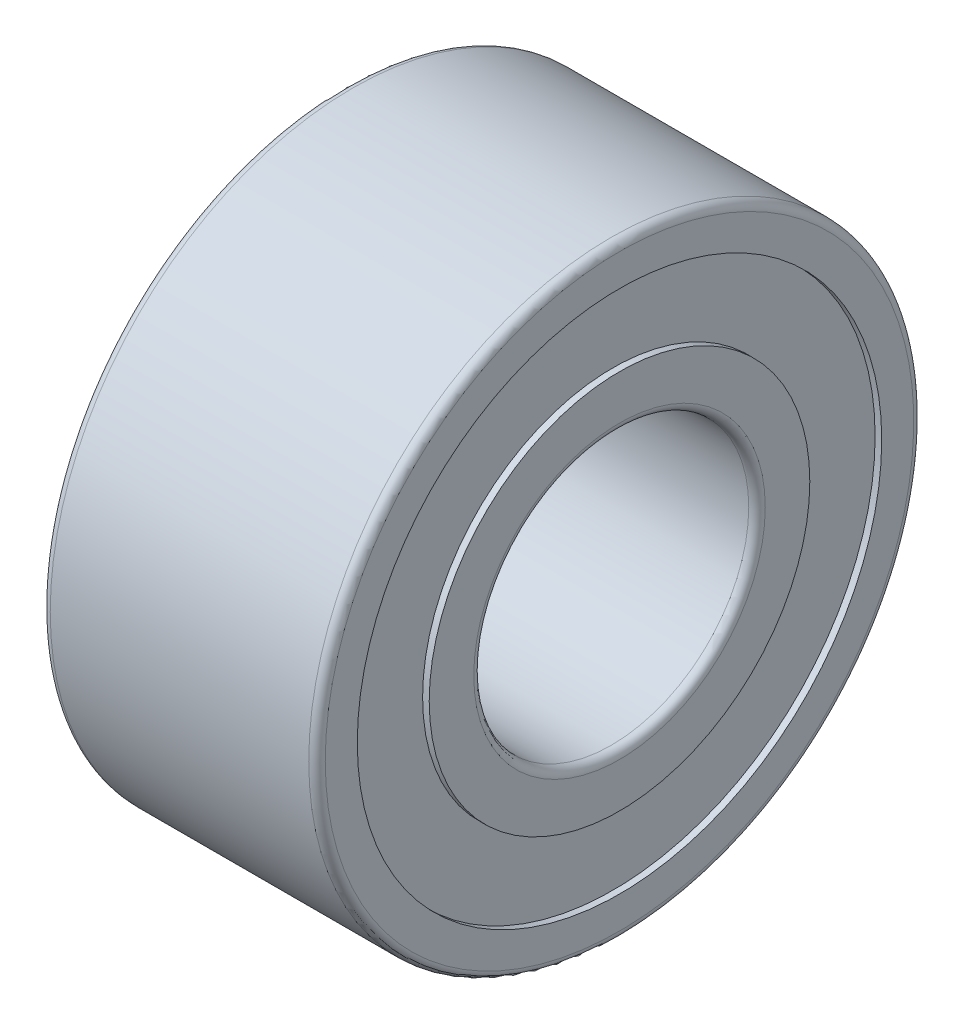
ISO-10303-21;
HEADER;
FILE_DESCRIPTION(('STEP AP214'),'2;1');
FILE_NAME('part.step','',(''),(''),'','','');
FILE_SCHEMA(('AUTOMOTIVE_DESIGN { 1 0 10303 214 1 1 1 1 }'));
ENDSEC;
DATA;
#1=APPLICATION_CONTEXT('core data for automotive mechanical design processes');
#2=APPLICATION_PROTOCOL_DEFINITION('international standard','automotive_design',2000,#1);
#3=PRODUCT_CONTEXT('',#1,'mechanical');
#4=PRODUCT('Part','Part','',(#3));
#5=PRODUCT_RELATED_PRODUCT_CATEGORY('part','',(#4));
#6=PRODUCT_DEFINITION_FORMATION('','',#4);
#7=PRODUCT_DEFINITION_CONTEXT('part definition',#1,'design');
#8=PRODUCT_DEFINITION('design','',#6,#7);
#9=PRODUCT_DEFINITION_SHAPE('','',#8);
#10=(LENGTH_UNIT() NAMED_UNIT(*) SI_UNIT(.MILLI.,.METRE.));
#11=(NAMED_UNIT(*) PLANE_ANGLE_UNIT() SI_UNIT($,.RADIAN.));
#12=(NAMED_UNIT(*) SI_UNIT($,.STERADIAN.) SOLID_ANGLE_UNIT());
#13=UNCERTAINTY_MEASURE_WITH_UNIT(LENGTH_MEASURE(1.E-05),#10,'distance_accuracy_value','');
#14=(GEOMETRIC_REPRESENTATION_CONTEXT(3) GLOBAL_UNCERTAINTY_ASSIGNED_CONTEXT((#13)) GLOBAL_UNIT_ASSIGNED_CONTEXT((#10,
#11,#12)) REPRESENTATION_CONTEXT('',''));
#15=CARTESIAN_POINT('',(0.,0.,0.));
#16=DIRECTION('',(0.,0.,1.));
#17=DIRECTION('',(1.,0.,0.));
#18=AXIS2_PLACEMENT_3D('',#15,#16,#17);
#19=CARTESIAN_POINT('',(0.,5.5,0.));
#20=DIRECTION('',(1.,0.,0.));
#21=DIRECTION('',(0.,0.,-1.));
#22=AXIS2_PLACEMENT_3D('',#19,#20,#21);
#23=PLANE('',#22);
#24=CARTESIAN_POINT('',(0.,0.,0.));
#25=DIRECTION('',(1.,0.,0.));
#26=DIRECTION('',(0.,0.,-1.));
#27=AXIS2_PLACEMENT_3D('',#24,#25,#26);
#28=CIRCLE('',#27,5.35);
#29=CARTESIAN_POINT('',(0.,0.,-5.35));
#30=VERTEX_POINT('',#29);
#31=EDGE_CURVE('E65',#30,#30,#28,.F.);
#32=ORIENTED_EDGE('',*,*,#31,.T.);
#33=EDGE_LOOP('',(#32));
#34=FACE_BOUND('',#33,.T.);
#35=CARTESIAN_POINT('',(0.,0.,0.));
#36=DIRECTION('',(-1.,0.,0.));
#37=DIRECTION('',(0.,0.,1.));
#38=AXIS2_PLACEMENT_3D('',#35,#36,#37);
#39=CIRCLE('',#38,4.7675);
#40=CARTESIAN_POINT('',(0.,0.,4.7675));
#41=VERTEX_POINT('',#40);
#42=EDGE_CURVE('E80',#41,#41,#39,.T.);
#43=ORIENTED_EDGE('',*,*,#42,.F.);
#44=EDGE_LOOP('',(#43));
#45=FACE_BOUND('',#44,.T.);
#46=ADVANCED_FACE('F37',(#34,#45),#23,.F.);
#47=CARTESIAN_POINT('',(0.,0.,0.));
#48=DIRECTION('',(-1.,0.,0.));
#49=DIRECTION('',(0.,0.,1.));
#50=AXIS2_PLACEMENT_3D('',#47,#48,#49);
#51=CYLINDRICAL_SURFACE('',#50,4.7675);
#52=CARTESIAN_POINT('',(0.12,0.,0.));
#53=DIRECTION('',(-1.,0.,0.));
#54=DIRECTION('',(0.,0.,1.));
#55=AXIS2_PLACEMENT_3D('',#52,#53,#54);
#56=CIRCLE('',#55,4.7675);
#57=CARTESIAN_POINT('',(0.12,0.,4.7675));
#58=VERTEX_POINT('',#57);
#59=EDGE_CURVE('E83',#58,#58,#56,.T.);
#60=ORIENTED_EDGE('',*,*,#59,.F.);
#61=EDGE_LOOP('',(#60));
#62=FACE_BOUND('',#61,.T.);
#63=ORIENTED_EDGE('',*,*,#42,.T.);
#64=EDGE_LOOP('',(#63));
#65=FACE_BOUND('',#64,.T.);
#66=ADVANCED_FACE('F142',(#62,#65),#51,.F.);
#67=CARTESIAN_POINT('',(0.12,4.7675,0.));
#68=DIRECTION('',(1.,0.,0.));
#69=DIRECTION('',(0.,0.,-1.));
#70=AXIS2_PLACEMENT_3D('',#67,#68,#69);
#71=PLANE('',#70);
#72=CARTESIAN_POINT('',(0.12,0.,0.));
#73=DIRECTION('',(-1.,0.,0.));
#74=DIRECTION('',(0.,0.,1.));
#75=AXIS2_PLACEMENT_3D('',#72,#73,#74);
#76=CIRCLE('',#75,3.46);
#77=CARTESIAN_POINT('',(0.12,0.,3.46));
#78=VERTEX_POINT('',#77);
#79=EDGE_CURVE('E87',#78,#78,#76,.T.);
#80=ORIENTED_EDGE('',*,*,#79,.F.);
#81=EDGE_LOOP('',(#80));
#82=FACE_BOUND('',#81,.T.);
#83=ORIENTED_EDGE('',*,*,#59,.T.);
#84=EDGE_LOOP('',(#83));
#85=FACE_BOUND('',#84,.T.);
#86=ADVANCED_FACE('F149',(#82,#85),#71,.F.);
#87=CARTESIAN_POINT('',(0.,0.,0.));
#88=DIRECTION('',(-1.,0.,0.));
#89=DIRECTION('',(0.,0.,1.));
#90=AXIS2_PLACEMENT_3D('',#87,#88,#89);
#91=CYLINDRICAL_SURFACE('',#90,3.46);
#92=CARTESIAN_POINT('',(0.,0.,0.));
#93=DIRECTION('',(-1.,0.,0.));
#94=DIRECTION('',(0.,0.,1.));
#95=AXIS2_PLACEMENT_3D('',#92,#93,#94);
#96=CIRCLE('',#95,3.46);
#97=CARTESIAN_POINT('',(0.,0.,3.46));
#98=VERTEX_POINT('',#97);
#99=EDGE_CURVE('E91',#98,#98,#96,.T.);
#100=ORIENTED_EDGE('',*,*,#99,.F.);
#101=EDGE_LOOP('',(#100));
#102=FACE_BOUND('',#101,.T.);
#103=ORIENTED_EDGE('',*,*,#79,.T.);
#104=EDGE_LOOP('',(#103));
#105=FACE_BOUND('',#104,.T.);
#106=ADVANCED_FACE('F205',(#102,#105),#91,.T.);
#107=CARTESIAN_POINT('',(0.,3.46,0.));
#108=DIRECTION('',(1.,0.,0.));
#109=DIRECTION('',(0.,0.,-1.));
#110=AXIS2_PLACEMENT_3D('',#107,#108,#109);
#111=PLANE('',#110);
#112=CARTESIAN_POINT('',(0.,0.,0.));
#113=DIRECTION('',(1.,0.,0.));
#114=DIRECTION('',(0.,0.,-1.));
#115=AXIS2_PLACEMENT_3D('',#112,#113,#114);
#116=CIRCLE('',#115,2.65);
#117=CARTESIAN_POINT('',(0.,0.,-2.65));
#118=VERTEX_POINT('',#117);
#119=EDGE_CURVE('E10',#118,#118,#116,.T.);
#120=ORIENTED_EDGE('',*,*,#119,.T.);
#121=EDGE_LOOP('',(#120));
#122=FACE_BOUND('',#121,.T.);
#123=ORIENTED_EDGE('',*,*,#99,.T.);
#124=EDGE_LOOP('',(#123));
#125=FACE_BOUND('',#124,.T.);
#126=ADVANCED_FACE('F139',(#122,#125),#111,.F.);
#127=CARTESIAN_POINT('',(0.,0.,0.));
#128=DIRECTION('',(-1.,0.,0.));
#129=DIRECTION('',(0.,0.,1.));
#130=AXIS2_PLACEMENT_3D('',#127,#128,#129);
#131=CYLINDRICAL_SURFACE('',#130,2.5);
#132=CARTESIAN_POINT('',(4.85,0.,0.));
#133=DIRECTION('',(-1.,0.,0.));
#134=DIRECTION('',(0.,0.,1.));
#135=AXIS2_PLACEMENT_3D('',#132,#133,#134);
#136=CIRCLE('',#135,2.5);
#137=CARTESIAN_POINT('',(4.85,0.,2.5));
#138=VERTEX_POINT('',#137);
#139=EDGE_CURVE('E45',#138,#138,#136,.F.);
#140=ORIENTED_EDGE('',*,*,#139,.T.);
#141=EDGE_LOOP('',(#140));
#142=FACE_BOUND('',#141,.T.);
#143=CARTESIAN_POINT('',(0.15,0.,0.));
#144=DIRECTION('',(1.,0.,0.));
#145=DIRECTION('',(0.,0.,-1.));
#146=AXIS2_PLACEMENT_3D('',#143,#144,#145);
#147=CIRCLE('',#146,2.5);
#148=CARTESIAN_POINT('',(0.15,0.,-2.5));
#149=VERTEX_POINT('',#148);
#150=EDGE_CURVE('E52',#149,#149,#147,.F.);
#151=ORIENTED_EDGE('',*,*,#150,.T.);
#152=EDGE_LOOP('',(#151));
#153=FACE_BOUND('',#152,.T.);
#154=ADVANCED_FACE('F132',(#142,#153),#131,.F.);
#155=CARTESIAN_POINT('',(5.,3.46,0.));
#156=DIRECTION('',(-1.,0.,0.));
#157=DIRECTION('',(0.,0.,1.));
#158=AXIS2_PLACEMENT_3D('',#155,#156,#157);
#159=PLANE('',#158);
#160=CARTESIAN_POINT('',(5.,0.,0.));
#161=DIRECTION('',(-1.,0.,0.));
#162=DIRECTION('',(0.,0.,1.));
#163=AXIS2_PLACEMENT_3D('',#160,#161,#162);
#164=CIRCLE('',#163,2.65);
#165=CARTESIAN_POINT('',(5.,0.,2.65));
#166=VERTEX_POINT('',#165);
#167=EDGE_CURVE('E59',#166,#166,#164,.T.);
#168=ORIENTED_EDGE('',*,*,#167,.T.);
#169=EDGE_LOOP('',(#168));
#170=FACE_BOUND('',#169,.T.);
#171=CARTESIAN_POINT('',(5.,0.,0.));
#172=DIRECTION('',(-1.,0.,0.));
#173=DIRECTION('',(0.,0.,1.));
#174=AXIS2_PLACEMENT_3D('',#171,#172,#173);
#175=CIRCLE('',#174,3.46);
#176=CARTESIAN_POINT('',(5.,0.,3.46));
#177=VERTEX_POINT('',#176);
#178=EDGE_CURVE('E94',#177,#177,#175,.T.);
#179=ORIENTED_EDGE('',*,*,#178,.F.);
#180=EDGE_LOOP('',(#179));
#181=FACE_BOUND('',#180,.T.);
#182=ADVANCED_FACE('F127',(#170,#181),#159,.F.);
#183=CARTESIAN_POINT('',(0.,0.,0.));
#184=DIRECTION('',(-1.,0.,0.));
#185=DIRECTION('',(0.,0.,1.));
#186=AXIS2_PLACEMENT_3D('',#183,#184,#185);
#187=CYLINDRICAL_SURFACE('',#186,3.46);
#188=CARTESIAN_POINT('',(4.88,0.,0.));
#189=DIRECTION('',(-1.,0.,0.));
#190=DIRECTION('',(0.,0.,1.));
#191=AXIS2_PLACEMENT_3D('',#188,#189,#190);
#192=CIRCLE('',#191,3.46);
#193=CARTESIAN_POINT('',(4.88,0.,3.46));
#194=VERTEX_POINT('',#193);
#195=EDGE_CURVE('E98',#194,#194,#192,.T.);
#196=ORIENTED_EDGE('',*,*,#195,.F.);
#197=EDGE_LOOP('',(#196));
#198=FACE_BOUND('',#197,.T.);
#199=ORIENTED_EDGE('',*,*,#178,.T.);
#200=EDGE_LOOP('',(#199));
#201=FACE_BOUND('',#200,.T.);
#202=ADVANCED_FACE('F121',(#198,#201),#187,.T.);
#203=CARTESIAN_POINT('',(4.88,4.7675,0.));
#204=DIRECTION('',(-1.,0.,0.));
#205=DIRECTION('',(0.,0.,1.));
#206=AXIS2_PLACEMENT_3D('',#203,#204,#205);
#207=PLANE('',#206);
#208=CARTESIAN_POINT('',(4.88,0.,0.));
#209=DIRECTION('',(-1.,0.,0.));
#210=DIRECTION('',(0.,0.,1.));
#211=AXIS2_PLACEMENT_3D('',#208,#209,#210);
#212=CIRCLE('',#211,4.7675);
#213=CARTESIAN_POINT('',(4.88,0.,4.7675));
#214=VERTEX_POINT('',#213);
#215=EDGE_CURVE('E102',#214,#214,#212,.T.);
#216=ORIENTED_EDGE('',*,*,#215,.F.);
#217=EDGE_LOOP('',(#216));
#218=FACE_BOUND('',#217,.T.);
#219=ORIENTED_EDGE('',*,*,#195,.T.);
#220=EDGE_LOOP('',(#219));
#221=FACE_BOUND('',#220,.T.);
#222=ADVANCED_FACE('F115',(#218,#221),#207,.F.);
#223=CARTESIAN_POINT('',(0.,0.,0.));
#224=DIRECTION('',(-1.,0.,0.));
#225=DIRECTION('',(0.,0.,1.));
#226=AXIS2_PLACEMENT_3D('',#223,#224,#225);
#227=CYLINDRICAL_SURFACE('',#226,4.7675);
#228=CARTESIAN_POINT('',(5.,0.,0.));
#229=DIRECTION('',(-1.,0.,0.));
#230=DIRECTION('',(0.,0.,1.));
#231=AXIS2_PLACEMENT_3D('',#228,#229,#230);
#232=CIRCLE('',#231,4.7675);
#233=CARTESIAN_POINT('',(5.,0.,4.7675));
#234=VERTEX_POINT('',#233);
#235=EDGE_CURVE('E105',#234,#234,#232,.T.);
#236=ORIENTED_EDGE('',*,*,#235,.F.);
#237=EDGE_LOOP('',(#236));
#238=FACE_BOUND('',#237,.T.);
#239=ORIENTED_EDGE('',*,*,#215,.T.);
#240=EDGE_LOOP('',(#239));
#241=FACE_BOUND('',#240,.T.);
#242=ADVANCED_FACE('F112',(#238,#241),#227,.F.);
#243=CARTESIAN_POINT('',(5.,5.5,0.));
#244=DIRECTION('',(-1.,0.,0.));
#245=DIRECTION('',(0.,0.,1.));
#246=AXIS2_PLACEMENT_3D('',#243,#244,#245);
#247=PLANE('',#246);
#248=CARTESIAN_POINT('',(5.,0.,0.));
#249=DIRECTION('',(-1.,0.,0.));
#250=DIRECTION('',(0.,0.,1.));
#251=AXIS2_PLACEMENT_3D('',#248,#249,#250);
#252=CIRCLE('',#251,5.35);
#253=CARTESIAN_POINT('',(5.,0.,5.35));
#254=VERTEX_POINT('',#253);
#255=EDGE_CURVE('E69',#254,#254,#252,.F.);
#256=ORIENTED_EDGE('',*,*,#255,.T.);
#257=EDGE_LOOP('',(#256));
#258=FACE_BOUND('',#257,.T.);
#259=ORIENTED_EDGE('',*,*,#235,.T.);
#260=EDGE_LOOP('',(#259));
#261=FACE_BOUND('',#260,.T.);
#262=ADVANCED_FACE('F110',(#258,#261),#247,.F.);
#263=CARTESIAN_POINT('',(0.,0.,0.));
#264=DIRECTION('',(-1.,0.,0.));
#265=DIRECTION('',(0.,0.,1.));
#266=AXIS2_PLACEMENT_3D('',#263,#264,#265);
#267=CYLINDRICAL_SURFACE('',#266,5.5);
#268=CARTESIAN_POINT('',(4.85,0.,0.));
#269=DIRECTION('',(-1.,0.,0.));
#270=DIRECTION('',(0.,0.,1.));
#271=AXIS2_PLACEMENT_3D('',#268,#269,#270);
#272=CIRCLE('',#271,5.5);
#273=CARTESIAN_POINT('',(4.85,0.,5.5));
#274=VERTEX_POINT('',#273);
#275=EDGE_CURVE('E73',#274,#274,#272,.T.);
#276=ORIENTED_EDGE('',*,*,#275,.T.);
#277=EDGE_LOOP('',(#276));
#278=FACE_BOUND('',#277,.T.);
#279=CARTESIAN_POINT('',(0.15,0.,0.));
#280=DIRECTION('',(1.,0.,0.));
#281=DIRECTION('',(0.,0.,-1.));
#282=AXIS2_PLACEMENT_3D('',#279,#280,#281);
#283=CIRCLE('',#282,5.5);
#284=CARTESIAN_POINT('',(0.15,0.,-5.5));
#285=VERTEX_POINT('',#284);
#286=EDGE_CURVE('E76',#285,#285,#283,.T.);
#287=ORIENTED_EDGE('',*,*,#286,.T.);
#288=EDGE_LOOP('',(#287));
#289=FACE_BOUND('',#288,.T.);
#290=ADVANCED_FACE('F159',(#278,#289),#267,.T.);
#291=CARTESIAN_POINT('',(4.85,0.,0.));
#292=DIRECTION('',(-1.,0.,0.));
#293=DIRECTION('',(0.,0.,1.));
#294=AXIS2_PLACEMENT_3D('',#291,#292,#293);
#295=TOROIDAL_SURFACE('',#294,5.35,0.15);
#296=ORIENTED_EDGE('',*,*,#255,.F.);
#297=EDGE_LOOP('',(#296));
#298=FACE_BOUND('',#297,.T.);
#299=ORIENTED_EDGE('',*,*,#275,.F.);
#300=EDGE_LOOP('',(#299));
#301=FACE_BOUND('',#300,.T.);
#302=ADVANCED_FACE('F155',(#298,#301),#295,.T.);
#303=CARTESIAN_POINT('',(0.15,0.,0.));
#304=DIRECTION('',(1.,0.,0.));
#305=DIRECTION('',(0.,0.,-1.));
#306=AXIS2_PLACEMENT_3D('',#303,#304,#305);
#307=TOROIDAL_SURFACE('',#306,5.35,0.15);
#308=ORIENTED_EDGE('',*,*,#286,.F.);
#309=EDGE_LOOP('',(#308));
#310=FACE_BOUND('',#309,.T.);
#311=ORIENTED_EDGE('',*,*,#31,.F.);
#312=EDGE_LOOP('',(#311));
#313=FACE_BOUND('',#312,.T.);
#314=ADVANCED_FACE('F158',(#310,#313),#307,.T.);
#315=CARTESIAN_POINT('',(4.85,0.,0.));
#316=DIRECTION('',(-1.,0.,0.));
#317=DIRECTION('',(0.,0.,1.));
#318=AXIS2_PLACEMENT_3D('',#315,#316,#317);
#319=TOROIDAL_SURFACE('',#318,2.65,0.15);
#320=ORIENTED_EDGE('',*,*,#139,.F.);
#321=EDGE_LOOP('',(#320));
#322=FACE_BOUND('',#321,.T.);
#323=ORIENTED_EDGE('',*,*,#167,.F.);
#324=EDGE_LOOP('',(#323));
#325=FACE_BOUND('',#324,.T.);
#326=ADVANCED_FACE('F162',(#322,#325),#319,.T.);
#327=CARTESIAN_POINT('',(0.15,0.,0.));
#328=DIRECTION('',(1.,0.,0.));
#329=DIRECTION('',(0.,0.,-1.));
#330=AXIS2_PLACEMENT_3D('',#327,#328,#329);
#331=TOROIDAL_SURFACE('',#330,2.65,0.15);
#332=ORIENTED_EDGE('',*,*,#119,.F.);
#333=EDGE_LOOP('',(#332));
#334=FACE_BOUND('',#333,.T.);
#335=ORIENTED_EDGE('',*,*,#150,.F.);
#336=EDGE_LOOP('',(#335));
#337=FACE_BOUND('',#336,.T.);
#338=ADVANCED_FACE('F39',(#334,#337),#331,.T.);
#339=CLOSED_SHELL('',(#46,#66,#86,#106,#126,#154,#182,#202,#222,#242,#262,#290,#302,#314,#326,#338));
#340=MANIFOLD_SOLID_BREP('B2',#339);
#341=ADVANCED_BREP_SHAPE_REPRESENTATION('',(#18,#340),#14);
#342=SHAPE_DEFINITION_REPRESENTATION(#9,#341);
ENDSEC;
END-ISO-10303-21;
